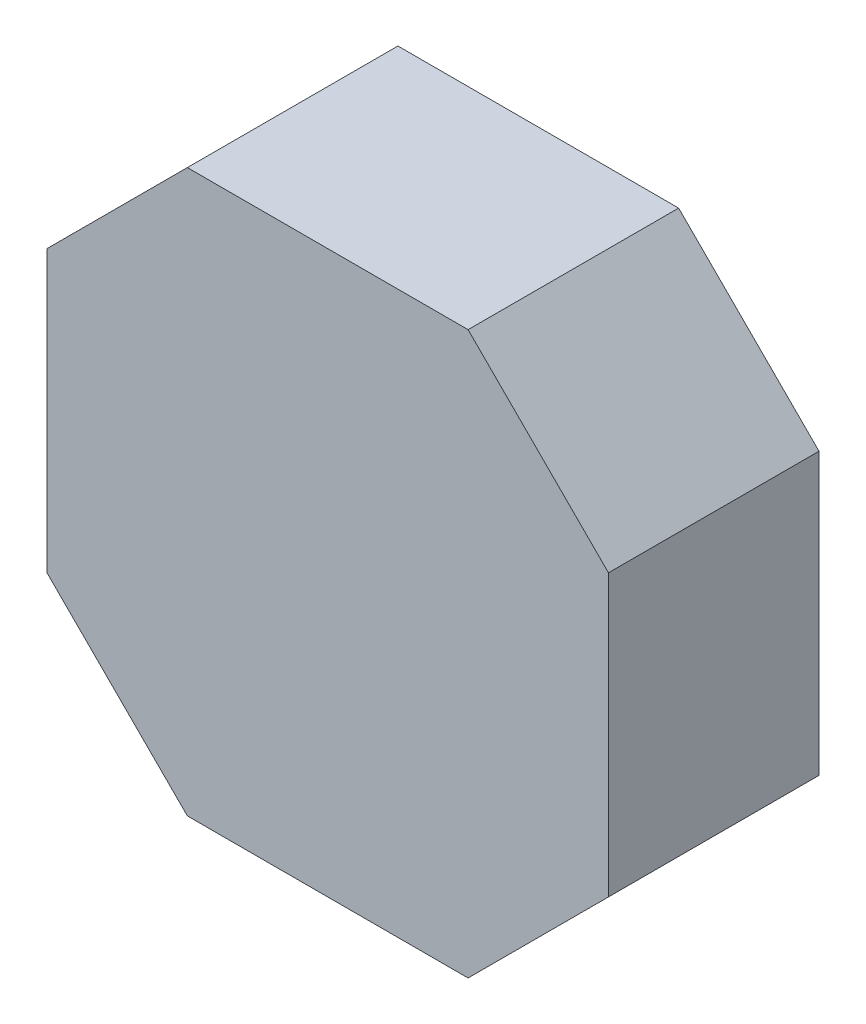
ISO-10303-21;
HEADER;
FILE_DESCRIPTION(('STEP AP214'),'2;1');
FILE_NAME('part.step','',(''),(''),'','','');
FILE_SCHEMA(('AUTOMOTIVE_DESIGN { 1 0 10303 214 1 1 1 1 }'));
ENDSEC;
DATA;
#1=APPLICATION_CONTEXT('core data for automotive mechanical design processes');
#2=APPLICATION_PROTOCOL_DEFINITION('international standard','automotive_design',2000,#1);
#3=PRODUCT_CONTEXT('',#1,'mechanical');
#4=PRODUCT('Part','Part','',(#3));
#5=PRODUCT_RELATED_PRODUCT_CATEGORY('part','',(#4));
#6=PRODUCT_DEFINITION_FORMATION('','',#4);
#7=PRODUCT_DEFINITION_CONTEXT('part definition',#1,'design');
#8=PRODUCT_DEFINITION('design','',#6,#7);
#9=PRODUCT_DEFINITION_SHAPE('','',#8);
#10=(LENGTH_UNIT() NAMED_UNIT(*) SI_UNIT(.MILLI.,.METRE.));
#11=(NAMED_UNIT(*) PLANE_ANGLE_UNIT() SI_UNIT($,.RADIAN.));
#12=(NAMED_UNIT(*) SI_UNIT($,.STERADIAN.) SOLID_ANGLE_UNIT());
#13=UNCERTAINTY_MEASURE_WITH_UNIT(LENGTH_MEASURE(1.E-05),#10,'distance_accuracy_value','');
#14=(GEOMETRIC_REPRESENTATION_CONTEXT(3) GLOBAL_UNCERTAINTY_ASSIGNED_CONTEXT((#13)) GLOBAL_UNIT_ASSIGNED_CONTEXT((#10,
#11,#12)) REPRESENTATION_CONTEXT('',''));
#15=CARTESIAN_POINT('',(0.,0.,0.));
#16=DIRECTION('',(0.,0.,1.));
#17=DIRECTION('',(1.,0.,0.));
#18=AXIS2_PLACEMENT_3D('',#15,#16,#17);
#19=CARTESIAN_POINT('',(-0.999998,-1.99999854,1.49999954));
#20=DIRECTION('',(0.,0.,1.));
#21=DIRECTION('',(1.,0.,0.));
#22=AXIS2_PLACEMENT_3D('',#19,#20,#21);
#23=PLANE('',#22);
#24=DIRECTION('',(0.,1.,0.));
#25=VECTOR('',#24,1.);
#26=CARTESIAN_POINT('',(-1.99999854,-0.999998,1.49999954));
#27=LINE('',#26,#25);
#28=CARTESIAN_POINT('',(-1.99999854,-0.999998,1.49999954));
#29=VERTEX_POINT('',#28);
#30=CARTESIAN_POINT('',(-1.99999854,1.00000308,1.49999954));
#31=VERTEX_POINT('',#30);
#32=EDGE_CURVE('E118',#29,#31,#27,.T.);
#33=ORIENTED_EDGE('',*,*,#32,.F.);
#34=DIRECTION('',(0.707106781186548,-0.707106781186548,0.));
#35=VECTOR('',#34,1.);
#36=CARTESIAN_POINT('',(-1.99999854,-0.999998,1.49999954));
#37=LINE('',#36,#35);
#38=CARTESIAN_POINT('',(-0.999997999999999,-1.99999854,1.49999954));
#39=VERTEX_POINT('',#38);
#40=EDGE_CURVE('E20',#29,#39,#37,.T.);
#41=ORIENTED_EDGE('',*,*,#40,.T.);
#42=DIRECTION('',(1.,0.,0.));
#43=VECTOR('',#42,1.);
#44=CARTESIAN_POINT('',(1.00000054,-1.99999854,1.49999954));
#45=LINE('',#44,#43);
#46=CARTESIAN_POINT('',(1.00000054,-1.99999854,1.49999954));
#47=VERTEX_POINT('',#46);
#48=EDGE_CURVE('E92',#47,#39,#45,.F.);
#49=ORIENTED_EDGE('',*,*,#48,.F.);
#50=DIRECTION('',(0.707106781186548,0.707106781186548,0.));
#51=VECTOR('',#50,1.);
#52=CARTESIAN_POINT('',(2.00000108,-0.999998,1.49999954));
#53=LINE('',#52,#51);
#54=CARTESIAN_POINT('',(2.00000108,-0.999998,1.49999954));
#55=VERTEX_POINT('',#54);
#56=EDGE_CURVE('E83',#55,#47,#53,.F.);
#57=ORIENTED_EDGE('',*,*,#56,.F.);
#58=DIRECTION('',(0.,1.,0.));
#59=VECTOR('',#58,1.);
#60=CARTESIAN_POINT('',(2.00000108,1.00000308,1.49999954));
#61=LINE('',#60,#59);
#62=CARTESIAN_POINT('',(2.00000107999991,1.00000307999991,1.49999954));
#63=VERTEX_POINT('',#62);
#64=EDGE_CURVE('E78',#63,#55,#61,.F.);
#65=ORIENTED_EDGE('',*,*,#64,.F.);
#66=DIRECTION('',(-0.707107679211977,0.707105883159977,0.));
#67=VECTOR('',#66,1.);
#68=CARTESIAN_POINT('',(1.00000054,2.00000108,1.49999954));
#69=LINE('',#68,#67);
#70=CARTESIAN_POINT('',(1.00000054,2.00000108,1.49999954));
#71=VERTEX_POINT('',#70);
#72=EDGE_CURVE('E106',#71,#63,#69,.F.);
#73=ORIENTED_EDGE('',*,*,#72,.F.);
#74=DIRECTION('',(1.,0.,0.));
#75=VECTOR('',#74,1.);
#76=CARTESIAN_POINT('',(-0.999998,2.00000108,1.49999954));
#77=LINE('',#76,#75);
#78=CARTESIAN_POINT('',(-0.999998000000095,2.00000108000009,1.49999954));
#79=VERTEX_POINT('',#78);
#80=EDGE_CURVE('E110',#79,#71,#77,.T.);
#81=ORIENTED_EDGE('',*,*,#80,.F.);
#82=DIRECTION('',(-0.707107679211977,-0.707105883159977,0.));
#83=VECTOR('',#82,1.);
#84=CARTESIAN_POINT('',(-1.99999854,1.00000308,1.49999954));
#85=LINE('',#84,#83);
#86=EDGE_CURVE('E114',#31,#79,#85,.F.);
#87=ORIENTED_EDGE('',*,*,#86,.F.);
#88=EDGE_LOOP('',(#33,#41,#49,#57,#65,#73,#81,#87));
#89=FACE_BOUND('',#88,.T.);
#90=ADVANCED_FACE('F17',(#89),#23,.T.);
#91=CARTESIAN_POINT('',(1.00000054,-1.99999854,0.));
#92=DIRECTION('',(0.,-1.,0.));
#93=DIRECTION('',(0.,0.,-1.));
#94=AXIS2_PLACEMENT_3D('',#91,#92,#93);
#95=PLANE('',#94);
#96=DIRECTION('',(0.,0.,1.));
#97=VECTOR('',#96,1.);
#98=CARTESIAN_POINT('',(-0.999998,-1.99999854,0.));
#99=LINE('',#98,#97);
#100=CARTESIAN_POINT('',(-0.999998,-1.99999854,0.));
#101=VERTEX_POINT('',#100);
#102=EDGE_CURVE('E122',#101,#39,#99,.T.);
#103=ORIENTED_EDGE('',*,*,#102,.F.);
#104=DIRECTION('',(1.,0.,0.));
#105=VECTOR('',#104,1.);
#106=CARTESIAN_POINT('',(-0.999998,-1.99999854,0.));
#107=LINE('',#106,#105);
#108=CARTESIAN_POINT('',(1.00000054,-1.99999854,0.));
#109=VERTEX_POINT('',#108);
#110=EDGE_CURVE('E101',#101,#109,#107,.T.);
#111=ORIENTED_EDGE('',*,*,#110,.T.);
#112=DIRECTION('',(0.,0.,1.));
#113=VECTOR('',#112,1.);
#114=CARTESIAN_POINT('',(1.00000054,-1.99999854,0.));
#115=LINE('',#114,#113);
#116=EDGE_CURVE('E88',#47,#109,#115,.F.);
#117=ORIENTED_EDGE('',*,*,#116,.F.);
#118=ORIENTED_EDGE('',*,*,#48,.T.);
#119=EDGE_LOOP('',(#103,#111,#117,#118));
#120=FACE_BOUND('',#119,.T.);
#121=ADVANCED_FACE('F100',(#120),#95,.T.);
#122=CARTESIAN_POINT('',(2.00000108,-0.999998,0.));
#123=DIRECTION('',(0.707106781186548,-0.707106781186548,0.));
#124=DIRECTION('',(0.707106781186548,0.707106781186548,0.));
#125=AXIS2_PLACEMENT_3D('',#122,#123,#124);
#126=PLANE('',#125);
#127=ORIENTED_EDGE('',*,*,#116,.T.);
#128=DIRECTION('',(0.707106781186548,0.707106781186548,0.));
#129=VECTOR('',#128,1.);
#130=CARTESIAN_POINT('',(1.00000054,-1.99999854,0.));
#131=LINE('',#130,#129);
#132=CARTESIAN_POINT('',(2.00000108,-0.999998,0.));
#133=VERTEX_POINT('',#132);
#134=EDGE_CURVE('E126',#109,#133,#131,.T.);
#135=ORIENTED_EDGE('',*,*,#134,.T.);
#136=DIRECTION('',(0.,0.,-1.));
#137=VECTOR('',#136,1.);
#138=CARTESIAN_POINT('',(2.00000108,-0.999998,0.));
#139=LINE('',#138,#137);
#140=EDGE_CURVE('E90',#55,#133,#139,.T.);
#141=ORIENTED_EDGE('',*,*,#140,.F.);
#142=ORIENTED_EDGE('',*,*,#56,.T.);
#143=EDGE_LOOP('',(#127,#135,#141,#142));
#144=FACE_BOUND('',#143,.T.);
#145=ADVANCED_FACE('F85',(#144),#126,.T.);
#146=CARTESIAN_POINT('',(2.00000108,1.00000308,0.));
#147=DIRECTION('',(1.,0.,0.));
#148=DIRECTION('',(0.,0.,-1.));
#149=AXIS2_PLACEMENT_3D('',#146,#147,#148);
#150=PLANE('',#149);
#151=ORIENTED_EDGE('',*,*,#140,.T.);
#152=DIRECTION('',(0.,1.,0.));
#153=VECTOR('',#152,1.);
#154=CARTESIAN_POINT('',(2.00000108,-1.99999854,0.));
#155=LINE('',#154,#153);
#156=CARTESIAN_POINT('',(2.00000107999991,1.00000307999991,0.));
#157=VERTEX_POINT('',#156);
#158=EDGE_CURVE('E128',#133,#157,#155,.T.);
#159=ORIENTED_EDGE('',*,*,#158,.T.);
#160=DIRECTION('',(0.,0.,1.));
#161=VECTOR('',#160,1.);
#162=CARTESIAN_POINT('',(2.00000107999962,1.00000307999962,0.));
#163=LINE('',#162,#161);
#164=EDGE_CURVE('E108',#63,#157,#163,.F.);
#165=ORIENTED_EDGE('',*,*,#164,.F.);
#166=ORIENTED_EDGE('',*,*,#64,.T.);
#167=EDGE_LOOP('',(#151,#159,#165,#166));
#168=FACE_BOUND('',#167,.T.);
#169=ADVANCED_FACE('F162',(#168),#150,.T.);
#170=CARTESIAN_POINT('',(1.00000054,2.00000108,0.));
#171=DIRECTION('',(0.707105883159977,0.707107679211977,0.));
#172=DIRECTION('',(-0.707107679211977,0.707105883159977,0.));
#173=AXIS2_PLACEMENT_3D('',#170,#171,#172);
#174=PLANE('',#173);
#175=ORIENTED_EDGE('',*,*,#164,.T.);
#176=DIRECTION('',(-0.707107679212245,0.707105883159709,0.));
#177=VECTOR('',#176,1.);
#178=CARTESIAN_POINT('',(2.00000108,1.00000308,0.));
#179=LINE('',#178,#177);
#180=CARTESIAN_POINT('',(1.00000054,2.00000108,0.));
#181=VERTEX_POINT('',#180);
#182=EDGE_CURVE('E131',#157,#181,#179,.T.);
#183=ORIENTED_EDGE('',*,*,#182,.T.);
#184=DIRECTION('',(0.,0.,1.));
#185=VECTOR('',#184,1.);
#186=CARTESIAN_POINT('',(1.00000054,2.00000108,0.));
#187=LINE('',#186,#185);
#188=EDGE_CURVE('E112',#71,#181,#187,.F.);
#189=ORIENTED_EDGE('',*,*,#188,.F.);
#190=ORIENTED_EDGE('',*,*,#72,.T.);
#191=EDGE_LOOP('',(#175,#183,#189,#190));
#192=FACE_BOUND('',#191,.T.);
#193=ADVANCED_FACE('F161',(#192),#174,.T.);
#194=CARTESIAN_POINT('',(-0.999998,2.00000108,0.));
#195=DIRECTION('',(0.,1.,0.));
#196=DIRECTION('',(0.,0.,1.));
#197=AXIS2_PLACEMENT_3D('',#194,#195,#196);
#198=PLANE('',#197);
#199=ORIENTED_EDGE('',*,*,#188,.T.);
#200=DIRECTION('',(1.,0.,0.));
#201=VECTOR('',#200,1.);
#202=CARTESIAN_POINT('',(-0.999998,2.00000108,0.));
#203=LINE('',#202,#201);
#204=CARTESIAN_POINT('',(-0.999998000000095,2.00000108000009,0.));
#205=VERTEX_POINT('',#204);
#206=EDGE_CURVE('E134',#181,#205,#203,.F.);
#207=ORIENTED_EDGE('',*,*,#206,.T.);
#208=DIRECTION('',(0.,0.,1.));
#209=VECTOR('',#208,1.);
#210=CARTESIAN_POINT('',(-0.999998000000379,2.00000108000038,0.));
#211=LINE('',#210,#209);
#212=EDGE_CURVE('E116',#79,#205,#211,.F.);
#213=ORIENTED_EDGE('',*,*,#212,.F.);
#214=ORIENTED_EDGE('',*,*,#80,.T.);
#215=EDGE_LOOP('',(#199,#207,#213,#214));
#216=FACE_BOUND('',#215,.T.);
#217=ADVANCED_FACE('F155',(#216),#198,.T.);
#218=CARTESIAN_POINT('',(-1.99999854,1.00000308,0.));
#219=DIRECTION('',(-0.707105883159977,0.707107679211977,0.));
#220=DIRECTION('',(-0.707107679211977,-0.707105883159977,0.));
#221=AXIS2_PLACEMENT_3D('',#218,#219,#220);
#222=PLANE('',#221);
#223=ORIENTED_EDGE('',*,*,#212,.T.);
#224=DIRECTION('',(-0.707107679212245,-0.707105883159709,0.));
#225=VECTOR('',#224,1.);
#226=CARTESIAN_POINT('',(-0.999998,2.00000108,0.));
#227=LINE('',#226,#225);
#228=CARTESIAN_POINT('',(-1.99999854,1.00000308,0.));
#229=VERTEX_POINT('',#228);
#230=EDGE_CURVE('E137',#205,#229,#227,.T.);
#231=ORIENTED_EDGE('',*,*,#230,.T.);
#232=DIRECTION('',(0.,0.,1.));
#233=VECTOR('',#232,1.);
#234=CARTESIAN_POINT('',(-1.99999854,1.00000308,0.));
#235=LINE('',#234,#233);
#236=EDGE_CURVE('E120',#31,#229,#235,.F.);
#237=ORIENTED_EDGE('',*,*,#236,.F.);
#238=ORIENTED_EDGE('',*,*,#86,.T.);
#239=EDGE_LOOP('',(#223,#231,#237,#238));
#240=FACE_BOUND('',#239,.T.);
#241=ADVANCED_FACE('F150',(#240),#222,.T.);
#242=CARTESIAN_POINT('',(-1.99999854,-0.999998,0.));
#243=DIRECTION('',(-1.,0.,0.));
#244=DIRECTION('',(0.,0.,1.));
#245=AXIS2_PLACEMENT_3D('',#242,#243,#244);
#246=PLANE('',#245);
#247=ORIENTED_EDGE('',*,*,#236,.T.);
#248=DIRECTION('',(0.,1.,0.));
#249=VECTOR('',#248,1.);
#250=CARTESIAN_POINT('',(-1.99999854,-1.99999854,0.));
#251=LINE('',#250,#249);
#252=CARTESIAN_POINT('',(-1.99999854,-0.999998,0.));
#253=VERTEX_POINT('',#252);
#254=EDGE_CURVE('E26',#229,#253,#251,.F.);
#255=ORIENTED_EDGE('',*,*,#254,.T.);
#256=DIRECTION('',(0.,0.,1.));
#257=VECTOR('',#256,1.);
#258=CARTESIAN_POINT('',(-1.99999854,-0.999998,0.));
#259=LINE('',#258,#257);
#260=EDGE_CURVE('E34',#29,#253,#259,.F.);
#261=ORIENTED_EDGE('',*,*,#260,.F.);
#262=ORIENTED_EDGE('',*,*,#32,.T.);
#263=EDGE_LOOP('',(#247,#255,#261,#262));
#264=FACE_BOUND('',#263,.T.);
#265=ADVANCED_FACE('F143',(#264),#246,.T.);
#266=CARTESIAN_POINT('',(-0.999998,-1.99999854,0.));
#267=DIRECTION('',(-0.707106781186548,-0.707106781186548,0.));
#268=DIRECTION('',(0.707106781186548,-0.707106781186548,0.));
#269=AXIS2_PLACEMENT_3D('',#266,#267,#268);
#270=PLANE('',#269);
#271=ORIENTED_EDGE('',*,*,#260,.T.);
#272=DIRECTION('',(0.707106781186548,-0.707106781186548,0.));
#273=VECTOR('',#272,1.);
#274=CARTESIAN_POINT('',(-1.99999854,-0.999998,0.));
#275=LINE('',#274,#273);
#276=EDGE_CURVE('E11',#253,#101,#275,.T.);
#277=ORIENTED_EDGE('',*,*,#276,.T.);
#278=ORIENTED_EDGE('',*,*,#102,.T.);
#279=ORIENTED_EDGE('',*,*,#40,.F.);
#280=EDGE_LOOP('',(#271,#277,#278,#279));
#281=FACE_BOUND('',#280,.T.);
#282=ADVANCED_FACE('F163',(#281),#270,.T.);
#283=CARTESIAN_POINT('',(-0.999998,-1.99999854,0.));
#284=DIRECTION('',(0.,0.,1.));
#285=DIRECTION('',(1.,0.,0.));
#286=AXIS2_PLACEMENT_3D('',#283,#284,#285);
#287=PLANE('',#286);
#288=ORIENTED_EDGE('',*,*,#254,.F.);
#289=ORIENTED_EDGE('',*,*,#230,.F.);
#290=ORIENTED_EDGE('',*,*,#206,.F.);
#291=ORIENTED_EDGE('',*,*,#182,.F.);
#292=ORIENTED_EDGE('',*,*,#158,.F.);
#293=ORIENTED_EDGE('',*,*,#134,.F.);
#294=ORIENTED_EDGE('',*,*,#110,.F.);
#295=ORIENTED_EDGE('',*,*,#276,.F.);
#296=EDGE_LOOP('',(#288,#289,#290,#291,#292,#293,#294,#295));
#297=FACE_BOUND('',#296,.T.);
#298=ADVANCED_FACE('F147',(#297),#287,.F.);
#299=CLOSED_SHELL('',(#90,#121,#145,#169,#193,#217,#241,#265,#282,#298));
#300=MANIFOLD_SOLID_BREP('B1',#299);
#301=ADVANCED_BREP_SHAPE_REPRESENTATION('',(#18,#300),#14);
#302=SHAPE_DEFINITION_REPRESENTATION(#9,#301);
ENDSEC;
END-ISO-10303-21;
